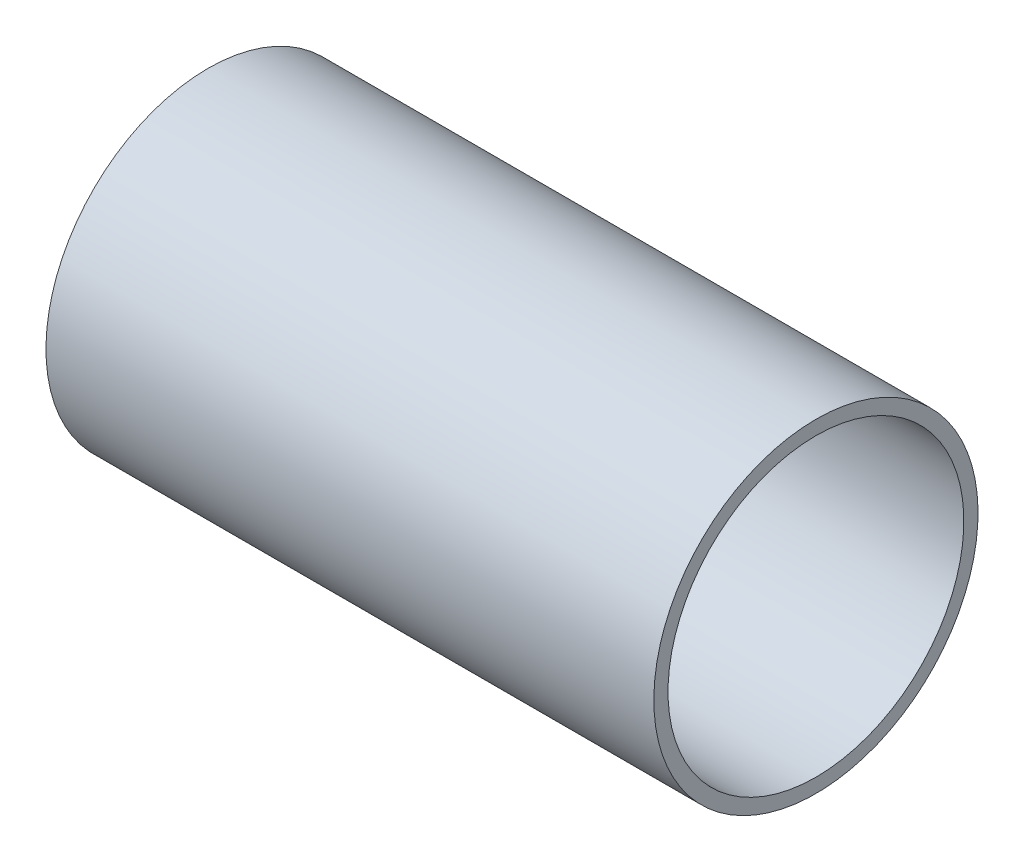
ISO-10303-21;
HEADER;
FILE_DESCRIPTION(('STEP AP214'),'2;1');
FILE_NAME('part.step','',(''),(''),'','','');
FILE_SCHEMA(('AUTOMOTIVE_DESIGN { 1 0 10303 214 1 1 1 1 }'));
ENDSEC;
DATA;
#1=APPLICATION_CONTEXT('core data for automotive mechanical design processes');
#2=APPLICATION_PROTOCOL_DEFINITION('international standard','automotive_design',2000,#1);
#3=PRODUCT_CONTEXT('',#1,'mechanical');
#4=PRODUCT('Part','Part','',(#3));
#5=PRODUCT_RELATED_PRODUCT_CATEGORY('part','',(#4));
#6=PRODUCT_DEFINITION_FORMATION('','',#4);
#7=PRODUCT_DEFINITION_CONTEXT('part definition',#1,'design');
#8=PRODUCT_DEFINITION('design','',#6,#7);
#9=PRODUCT_DEFINITION_SHAPE('','',#8);
#10=(LENGTH_UNIT() NAMED_UNIT(*) SI_UNIT(.MILLI.,.METRE.));
#11=(NAMED_UNIT(*) PLANE_ANGLE_UNIT() SI_UNIT($,.RADIAN.));
#12=(NAMED_UNIT(*) SI_UNIT($,.STERADIAN.) SOLID_ANGLE_UNIT());
#13=UNCERTAINTY_MEASURE_WITH_UNIT(LENGTH_MEASURE(1.E-05),#10,'distance_accuracy_value','');
#14=(GEOMETRIC_REPRESENTATION_CONTEXT(3) GLOBAL_UNCERTAINTY_ASSIGNED_CONTEXT((#13)) GLOBAL_UNIT_ASSIGNED_CONTEXT((#10,
#11,#12)) REPRESENTATION_CONTEXT('',''));
#15=CARTESIAN_POINT('',(0.,0.,0.));
#16=DIRECTION('',(0.,0.,1.));
#17=DIRECTION('',(1.,0.,0.));
#18=AXIS2_PLACEMENT_3D('',#15,#16,#17);
#19=CARTESIAN_POINT('',(-150.,0.,0.));
#20=DIRECTION('',(1.,0.,0.));
#21=DIRECTION('',(0.,0.,-1.));
#22=AXIS2_PLACEMENT_3D('',#19,#20,#21);
#23=CYLINDRICAL_SURFACE('',#22,40.);
#24=CARTESIAN_POINT('',(-150.,0.,0.));
#25=DIRECTION('',(-1.,0.,0.));
#26=DIRECTION('',(0.,1.,0.));
#27=AXIS2_PLACEMENT_3D('',#24,#25,#26);
#28=CIRCLE('',#27,40.);
#29=CARTESIAN_POINT('',(-150.,40.,0.));
#30=VERTEX_POINT('',#29);
#31=EDGE_CURVE('E10',#30,#30,#28,.T.);
#32=ORIENTED_EDGE('',*,*,#31,.F.);
#33=EDGE_LOOP('',(#32));
#34=FACE_BOUND('',#33,.T.);
#35=CARTESIAN_POINT('',(0.,0.,0.));
#36=DIRECTION('',(-1.,0.,0.));
#37=DIRECTION('',(0.,1.,0.));
#38=AXIS2_PLACEMENT_3D('',#35,#36,#37);
#39=CIRCLE('',#38,40.);
#40=CARTESIAN_POINT('',(0.,40.,0.));
#41=VERTEX_POINT('',#40);
#42=EDGE_CURVE('E19',#41,#41,#39,.T.);
#43=ORIENTED_EDGE('',*,*,#42,.T.);
#44=EDGE_LOOP('',(#43));
#45=FACE_BOUND('',#44,.T.);
#46=ADVANCED_FACE('F16',(#34,#45),#23,.T.);
#47=CARTESIAN_POINT('',(-150.,0.,0.));
#48=DIRECTION('',(-1.,0.,0.));
#49=DIRECTION('',(0.,-1.,0.));
#50=AXIS2_PLACEMENT_3D('',#47,#48,#49);
#51=PLANE('',#50);
#52=CARTESIAN_POINT('',(-150.,0.,0.));
#53=DIRECTION('',(-1.,0.,0.));
#54=DIRECTION('',(0.,-1.,0.));
#55=AXIS2_PLACEMENT_3D('',#52,#53,#54);
#56=CIRCLE('',#55,36.5);
#57=CARTESIAN_POINT('',(-150.,-36.5,0.));
#58=VERTEX_POINT('',#57);
#59=EDGE_CURVE('E27',#58,#58,#56,.T.);
#60=ORIENTED_EDGE('',*,*,#59,.F.);
#61=EDGE_LOOP('',(#60));
#62=FACE_BOUND('',#61,.T.);
#63=ORIENTED_EDGE('',*,*,#31,.T.);
#64=EDGE_LOOP('',(#63));
#65=FACE_BOUND('',#64,.T.);
#66=ADVANCED_FACE('F44',(#62,#65),#51,.T.);
#67=CARTESIAN_POINT('',(0.,0.,0.));
#68=DIRECTION('',(-1.,0.,0.));
#69=DIRECTION('',(0.,-1.,0.));
#70=AXIS2_PLACEMENT_3D('',#67,#68,#69);
#71=PLANE('',#70);
#72=CARTESIAN_POINT('',(0.,0.,0.));
#73=DIRECTION('',(1.,0.,0.));
#74=DIRECTION('',(0.,1.,0.));
#75=AXIS2_PLACEMENT_3D('',#72,#73,#74);
#76=CIRCLE('',#75,36.5);
#77=CARTESIAN_POINT('',(0.,36.5,0.));
#78=VERTEX_POINT('',#77);
#79=EDGE_CURVE('E31',#78,#78,#76,.T.);
#80=ORIENTED_EDGE('',*,*,#79,.F.);
#81=EDGE_LOOP('',(#80));
#82=FACE_BOUND('',#81,.T.);
#83=ORIENTED_EDGE('',*,*,#42,.F.);
#84=EDGE_LOOP('',(#83));
#85=FACE_BOUND('',#84,.T.);
#86=ADVANCED_FACE('F41',(#82,#85),#71,.F.);
#87=CARTESIAN_POINT('',(-187.88294228056,0.,0.));
#88=DIRECTION('',(1.,0.,0.));
#89=DIRECTION('',(0.,1.,0.));
#90=AXIS2_PLACEMENT_3D('',#87,#88,#89);
#91=CYLINDRICAL_SURFACE('',#90,36.5);
#92=ORIENTED_EDGE('',*,*,#79,.T.);
#93=EDGE_LOOP('',(#92));
#94=FACE_BOUND('',#93,.T.);
#95=ORIENTED_EDGE('',*,*,#59,.T.);
#96=EDGE_LOOP('',(#95));
#97=FACE_BOUND('',#96,.T.);
#98=ADVANCED_FACE('F38',(#94,#97),#91,.F.);
#99=CLOSED_SHELL('',(#46,#66,#86,#98));
#100=MANIFOLD_SOLID_BREP('B1',#99);
#101=ADVANCED_BREP_SHAPE_REPRESENTATION('',(#18,#100),#14);
#102=SHAPE_DEFINITION_REPRESENTATION(#9,#101);
ENDSEC;
END-ISO-10303-21;
